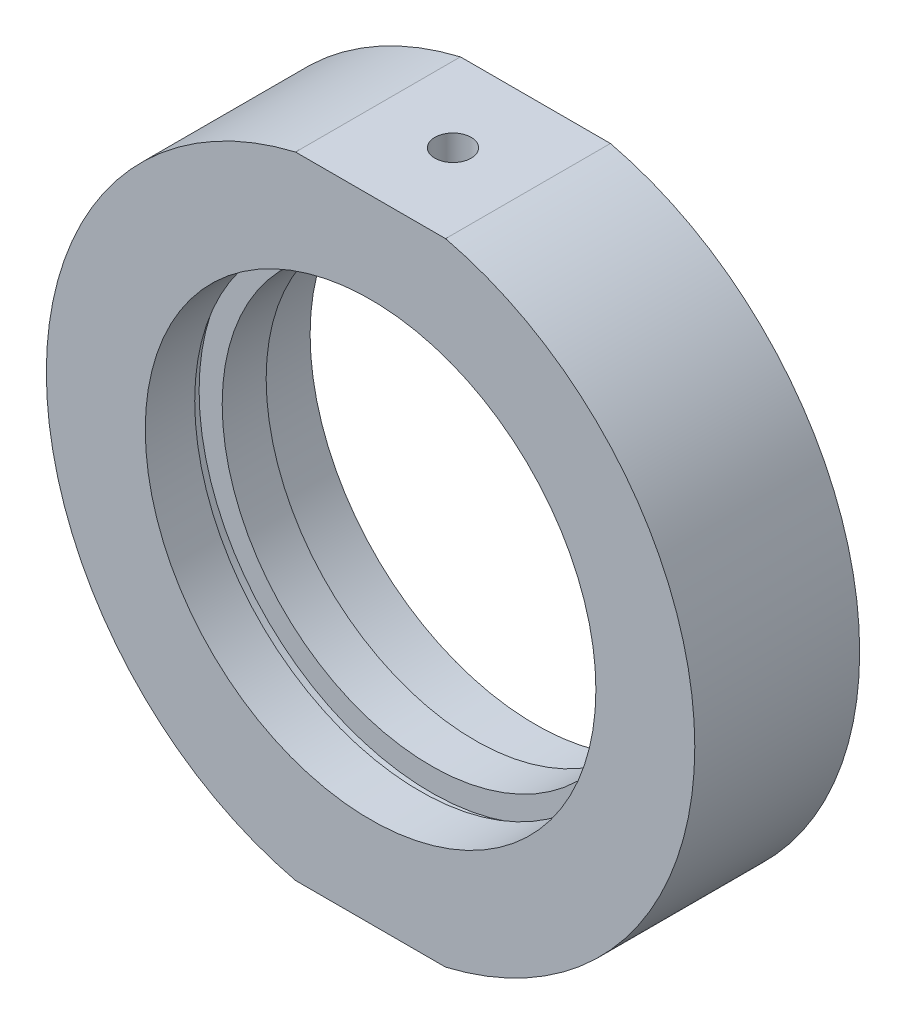
ISO-10303-21;
HEADER;
FILE_DESCRIPTION(('STEP AP214'),'2;1');
FILE_NAME('part.step','',(''),(''),'','','');
FILE_SCHEMA(('AUTOMOTIVE_DESIGN { 1 0 10303 214 1 1 1 1 }'));
ENDSEC;
DATA;
#1=APPLICATION_CONTEXT('core data for automotive mechanical design processes');
#2=APPLICATION_PROTOCOL_DEFINITION('international standard','automotive_design',2000,#1);
#3=PRODUCT_CONTEXT('',#1,'mechanical');
#4=PRODUCT('Part','Part','',(#3));
#5=PRODUCT_RELATED_PRODUCT_CATEGORY('part','',(#4));
#6=PRODUCT_DEFINITION_FORMATION('','',#4);
#7=PRODUCT_DEFINITION_CONTEXT('part definition',#1,'design');
#8=PRODUCT_DEFINITION('design','',#6,#7);
#9=PRODUCT_DEFINITION_SHAPE('','',#8);
#10=(LENGTH_UNIT() NAMED_UNIT(*) SI_UNIT(.MILLI.,.METRE.));
#11=(NAMED_UNIT(*) PLANE_ANGLE_UNIT() SI_UNIT($,.RADIAN.));
#12=(NAMED_UNIT(*) SI_UNIT($,.STERADIAN.) SOLID_ANGLE_UNIT());
#13=UNCERTAINTY_MEASURE_WITH_UNIT(LENGTH_MEASURE(1.E-05),#10,'distance_accuracy_value','');
#14=(GEOMETRIC_REPRESENTATION_CONTEXT(3) GLOBAL_UNCERTAINTY_ASSIGNED_CONTEXT((#13)) GLOBAL_UNIT_ASSIGNED_CONTEXT((#10,
#11,#12)) REPRESENTATION_CONTEXT('',''));
#15=CARTESIAN_POINT('',(0.,0.,0.));
#16=DIRECTION('',(0.,0.,1.));
#17=DIRECTION('',(1.,0.,0.));
#18=AXIS2_PLACEMENT_3D('',#15,#16,#17);
#19=CARTESIAN_POINT('',(0.,0.,-31.9390681003584));
#20=DIRECTION('',(0.,0.,-1.));
#21=DIRECTION('',(-1.,0.,0.));
#22=AXIS2_PLACEMENT_3D('',#19,#20,#21);
#23=CYLINDRICAL_SURFACE('',#22,29.5);
#24=CARTESIAN_POINT('',(0.,0.,7.5));
#25=DIRECTION('',(0.,0.,-1.));
#26=DIRECTION('',(-1.,0.,0.));
#27=AXIS2_PLACEMENT_3D('',#24,#25,#26);
#28=CIRCLE('',#27,29.5);
#29=CARTESIAN_POINT('',(6.82348884369279,28.7,7.5));
#30=VERTEX_POINT('',#29);
#31=CARTESIAN_POINT('',(6.82348884369279,-28.7,7.5));
#32=VERTEX_POINT('',#31);
#33=EDGE_CURVE('E132',#30,#32,#28,.T.);
#34=ORIENTED_EDGE('',*,*,#33,.T.);
#35=DIRECTION('',(0.,0.,-1.));
#36=VECTOR('',#35,1.);
#37=CARTESIAN_POINT('',(6.82348884369281,-28.7,-31.9390681003584));
#38=LINE('',#37,#36);
#39=CARTESIAN_POINT('',(6.82348884369279,-28.7,-7.5));
#40=VERTEX_POINT('',#39);
#41=EDGE_CURVE('E106',#32,#40,#38,.T.);
#42=ORIENTED_EDGE('',*,*,#41,.T.);
#43=CARTESIAN_POINT('',(0.,0.,-7.5));
#44=DIRECTION('',(0.,0.,-1.));
#45=DIRECTION('',(-1.,0.,0.));
#46=AXIS2_PLACEMENT_3D('',#43,#44,#45);
#47=CIRCLE('',#46,29.5);
#48=CARTESIAN_POINT('',(6.82348884369279,28.7,-7.5));
#49=VERTEX_POINT('',#48);
#50=EDGE_CURVE('E128',#49,#40,#47,.T.);
#51=ORIENTED_EDGE('',*,*,#50,.F.);
#52=DIRECTION('',(0.,0.,-1.));
#53=VECTOR('',#52,1.);
#54=CARTESIAN_POINT('',(6.82348884369281,28.7,-31.9390681003584));
#55=LINE('',#54,#53);
#56=EDGE_CURVE('E59',#49,#30,#55,.F.);
#57=ORIENTED_EDGE('',*,*,#56,.T.);
#58=EDGE_LOOP('',(#34,#42,#51,#57));
#59=FACE_BOUND('',#58,.T.);
#60=ADVANCED_FACE('F37',(#59),#23,.T.);
#61=CARTESIAN_POINT('',(19.,0.,-2.));
#62=DIRECTION('',(0.,0.,1.));
#63=DIRECTION('',(1.,0.,0.));
#64=AXIS2_PLACEMENT_3D('',#61,#62,#63);
#65=PLANE('',#64);
#66=CARTESIAN_POINT('',(0.,0.,-2.));
#67=DIRECTION('',(0.,0.,-1.));
#68=DIRECTION('',(-1.,0.,0.));
#69=AXIS2_PLACEMENT_3D('',#66,#67,#68);
#70=CIRCLE('',#69,19.);
#71=CARTESIAN_POINT('',(-19.,0.,-2.));
#72=VERTEX_POINT('',#71);
#73=EDGE_CURVE('E150',#72,#72,#70,.T.);
#74=ORIENTED_EDGE('',*,*,#73,.F.);
#75=EDGE_LOOP('',(#74));
#76=FACE_BOUND('',#75,.T.);
#77=CARTESIAN_POINT('',(0.,0.,-2.));
#78=DIRECTION('',(0.,0.,-1.));
#79=DIRECTION('',(-1.,0.,0.));
#80=AXIS2_PLACEMENT_3D('',#77,#78,#79);
#81=CIRCLE('',#80,21.1);
#82=CARTESIAN_POINT('',(-21.1,0.,-2.));
#83=VERTEX_POINT('',#82);
#84=EDGE_CURVE('E115',#83,#83,#81,.T.);
#85=ORIENTED_EDGE('',*,*,#84,.T.);
#86=EDGE_LOOP('',(#85));
#87=FACE_BOUND('',#86,.T.);
#88=ADVANCED_FACE('F39',(#76,#87),#65,.F.);
#89=CARTESIAN_POINT('',(0.,0.,-31.9390681003584));
#90=DIRECTION('',(0.,0.,-1.));
#91=DIRECTION('',(-1.,0.,0.));
#92=AXIS2_PLACEMENT_3D('',#89,#90,#91);
#93=CYLINDRICAL_SURFACE('',#92,19.);
#94=CARTESIAN_POINT('',(0.,0.,2.));
#95=DIRECTION('',(0.,0.,-1.));
#96=DIRECTION('',(-1.,0.,0.));
#97=AXIS2_PLACEMENT_3D('',#94,#95,#96);
#98=CIRCLE('',#97,19.);
#99=CARTESIAN_POINT('',(-19.,0.,2.));
#100=VERTEX_POINT('',#99);
#101=EDGE_CURVE('E147',#100,#100,#98,.T.);
#102=ORIENTED_EDGE('',*,*,#101,.F.);
#103=EDGE_LOOP('',(#102));
#104=FACE_BOUND('',#103,.T.);
#105=ORIENTED_EDGE('',*,*,#73,.T.);
#106=EDGE_LOOP('',(#105));
#107=FACE_BOUND('',#106,.T.);
#108=ADVANCED_FACE('F189',(#104,#107),#93,.F.);
#109=CARTESIAN_POINT('',(21.1,0.,2.));
#110=DIRECTION('',(0.,0.,-1.));
#111=DIRECTION('',(-1.,0.,0.));
#112=AXIS2_PLACEMENT_3D('',#109,#110,#111);
#113=PLANE('',#112);
#114=CARTESIAN_POINT('',(0.,0.,1.99999999999999));
#115=DIRECTION('',(0.,0.,-1.));
#116=DIRECTION('',(-1.,0.,0.));
#117=AXIS2_PLACEMENT_3D('',#114,#115,#116);
#118=CIRCLE('',#117,21.1);
#119=CARTESIAN_POINT('',(-21.1,0.,2.));
#120=VERTEX_POINT('',#119);
#121=EDGE_CURVE('E144',#120,#120,#118,.T.);
#122=ORIENTED_EDGE('',*,*,#121,.F.);
#123=EDGE_LOOP('',(#122));
#124=FACE_BOUND('',#123,.T.);
#125=ORIENTED_EDGE('',*,*,#101,.T.);
#126=EDGE_LOOP('',(#125));
#127=FACE_BOUND('',#126,.T.);
#128=ADVANCED_FACE('F214',(#124,#127),#113,.F.);
#129=CARTESIAN_POINT('',(0.,0.,-31.9390681003584));
#130=DIRECTION('',(0.,0.,-1.));
#131=DIRECTION('',(-1.,0.,0.));
#132=AXIS2_PLACEMENT_3D('',#129,#130,#131);
#133=CYLINDRICAL_SURFACE('',#132,21.1);
#134=CARTESIAN_POINT('',(0.,0.,3.));
#135=DIRECTION('',(0.,0.,-1.));
#136=DIRECTION('',(-1.,0.,0.));
#137=AXIS2_PLACEMENT_3D('',#134,#135,#136);
#138=CIRCLE('',#137,21.1);
#139=CARTESIAN_POINT('',(-21.1,0.,3.));
#140=VERTEX_POINT('',#139);
#141=EDGE_CURVE('E141',#140,#140,#138,.T.);
#142=ORIENTED_EDGE('',*,*,#141,.F.);
#143=EDGE_LOOP('',(#142));
#144=FACE_BOUND('',#143,.T.);
#145=ORIENTED_EDGE('',*,*,#121,.T.);
#146=EDGE_LOOP('',(#145));
#147=FACE_BOUND('',#146,.T.);
#148=ADVANCED_FACE('F210',(#144,#147),#133,.F.);
#149=CARTESIAN_POINT('',(21.1,0.,3.));
#150=DIRECTION('',(0.,0.,1.));
#151=DIRECTION('',(1.,0.,0.));
#152=AXIS2_PLACEMENT_3D('',#149,#150,#151);
#153=PLANE('',#152);
#154=CARTESIAN_POINT('',(0.,0.,3.));
#155=DIRECTION('',(0.,0.,-1.));
#156=DIRECTION('',(-1.,0.,0.));
#157=AXIS2_PLACEMENT_3D('',#154,#155,#156);
#158=CIRCLE('',#157,20.5);
#159=CARTESIAN_POINT('',(-20.5,0.,3.));
#160=VERTEX_POINT('',#159);
#161=EDGE_CURVE('E138',#160,#160,#158,.T.);
#162=ORIENTED_EDGE('',*,*,#161,.F.);
#163=EDGE_LOOP('',(#162));
#164=FACE_BOUND('',#163,.T.);
#165=ORIENTED_EDGE('',*,*,#141,.T.);
#166=EDGE_LOOP('',(#165));
#167=FACE_BOUND('',#166,.T.);
#168=ADVANCED_FACE('F204',(#164,#167),#153,.F.);
#169=CARTESIAN_POINT('',(0.,0.,-31.9390681003584));
#170=DIRECTION('',(0.,0.,-1.));
#171=DIRECTION('',(-1.,0.,0.));
#172=AXIS2_PLACEMENT_3D('',#169,#170,#171);
#173=CYLINDRICAL_SURFACE('',#172,20.5);
#174=CARTESIAN_POINT('',(0.,0.,7.5));
#175=DIRECTION('',(0.,0.,-1.));
#176=DIRECTION('',(-1.,0.,0.));
#177=AXIS2_PLACEMENT_3D('',#174,#175,#176);
#178=CIRCLE('',#177,20.5);
#179=CARTESIAN_POINT('',(-20.5,0.,7.5));
#180=VERTEX_POINT('',#179);
#181=EDGE_CURVE('E135',#180,#180,#178,.T.);
#182=ORIENTED_EDGE('',*,*,#181,.F.);
#183=EDGE_LOOP('',(#182));
#184=FACE_BOUND('',#183,.T.);
#185=ORIENTED_EDGE('',*,*,#161,.T.);
#186=EDGE_LOOP('',(#185));
#187=FACE_BOUND('',#186,.T.);
#188=ADVANCED_FACE('F200',(#184,#187),#173,.F.);
#189=CARTESIAN_POINT('',(29.5,0.,7.5));
#190=DIRECTION('',(0.,0.,-1.));
#191=DIRECTION('',(-1.,0.,0.));
#192=AXIS2_PLACEMENT_3D('',#189,#190,#191);
#193=PLANE('',#192);
#194=CARTESIAN_POINT('',(-6.82348884369278,-28.7,7.5));
#195=VERTEX_POINT('',#194);
#196=CARTESIAN_POINT('',(-6.82348884369278,28.7,7.5));
#197=VERTEX_POINT('',#196);
#198=EDGE_CURVE('E131',#195,#197,#28,.T.);
#199=ORIENTED_EDGE('',*,*,#198,.F.);
#200=DIRECTION('',(-1.,0.,0.));
#201=VECTOR('',#200,1.);
#202=CARTESIAN_POINT('',(-33.1519726534682,-28.7,7.5));
#203=LINE('',#202,#201);
#204=EDGE_CURVE('E103',#32,#195,#203,.T.);
#205=ORIENTED_EDGE('',*,*,#204,.F.);
#206=ORIENTED_EDGE('',*,*,#33,.F.);
#207=DIRECTION('',(1.,0.,0.));
#208=VECTOR('',#207,1.);
#209=CARTESIAN_POINT('',(-33.1519726534682,28.7,7.5));
#210=LINE('',#209,#208);
#211=EDGE_CURVE('E109',#197,#30,#210,.T.);
#212=ORIENTED_EDGE('',*,*,#211,.F.);
#213=EDGE_LOOP('',(#199,#205,#206,#212));
#214=FACE_BOUND('',#213,.T.);
#215=ORIENTED_EDGE('',*,*,#181,.T.);
#216=EDGE_LOOP('',(#215));
#217=FACE_BOUND('',#216,.T.);
#218=ADVANCED_FACE('F163',(#214,#217),#193,.F.);
#219=CARTESIAN_POINT('',(-6.82348884369279,-28.7,-7.5));
#220=VERTEX_POINT('',#219);
#221=CARTESIAN_POINT('',(-6.82348884369279,28.7,-7.5));
#222=VERTEX_POINT('',#221);
#223=EDGE_CURVE('E127',#220,#222,#47,.T.);
#224=ORIENTED_EDGE('',*,*,#223,.F.);
#225=DIRECTION('',(0.,0.,-1.));
#226=VECTOR('',#225,1.);
#227=CARTESIAN_POINT('',(-6.82348884369281,-28.7,-31.9390681003584));
#228=LINE('',#227,#226);
#229=EDGE_CURVE('E52',#220,#195,#228,.F.);
#230=ORIENTED_EDGE('',*,*,#229,.T.);
#231=ORIENTED_EDGE('',*,*,#198,.T.);
#232=DIRECTION('',(0.,0.,-1.));
#233=VECTOR('',#232,1.);
#234=CARTESIAN_POINT('',(-6.82348884369281,28.7,-31.9390681003584));
#235=LINE('',#234,#233);
#236=EDGE_CURVE('E112',#197,#222,#235,.T.);
#237=ORIENTED_EDGE('',*,*,#236,.T.);
#238=EDGE_LOOP('',(#224,#230,#231,#237));
#239=FACE_BOUND('',#238,.T.);
#240=ADVANCED_FACE('F167',(#239),#23,.T.);
#241=CARTESIAN_POINT('',(20.5,0.,-7.5));
#242=DIRECTION('',(0.,0.,1.));
#243=DIRECTION('',(1.,0.,0.));
#244=AXIS2_PLACEMENT_3D('',#241,#242,#243);
#245=PLANE('',#244);
#246=CARTESIAN_POINT('',(0.,0.,-7.5));
#247=DIRECTION('',(0.,0.,-1.));
#248=DIRECTION('',(-1.,0.,0.));
#249=AXIS2_PLACEMENT_3D('',#246,#247,#248);
#250=CIRCLE('',#249,20.5);
#251=CARTESIAN_POINT('',(-20.5,0.,-7.5));
#252=VERTEX_POINT('',#251);
#253=EDGE_CURVE('E124',#252,#252,#250,.T.);
#254=ORIENTED_EDGE('',*,*,#253,.F.);
#255=EDGE_LOOP('',(#254));
#256=FACE_BOUND('',#255,.T.);
#257=ORIENTED_EDGE('',*,*,#50,.T.);
#258=DIRECTION('',(-1.,0.,0.));
#259=VECTOR('',#258,1.);
#260=CARTESIAN_POINT('',(20.5,-28.7,-7.5));
#261=LINE('',#260,#259);
#262=EDGE_CURVE('E11',#40,#220,#261,.T.);
#263=ORIENTED_EDGE('',*,*,#262,.T.);
#264=ORIENTED_EDGE('',*,*,#223,.T.);
#265=DIRECTION('',(1.,0.,0.));
#266=VECTOR('',#265,1.);
#267=CARTESIAN_POINT('',(20.5,28.7,-7.5));
#268=LINE('',#267,#266);
#269=EDGE_CURVE('E45',#222,#49,#268,.T.);
#270=ORIENTED_EDGE('',*,*,#269,.T.);
#271=EDGE_LOOP('',(#257,#263,#264,#270));
#272=FACE_BOUND('',#271,.T.);
#273=ADVANCED_FACE('F154',(#256,#272),#245,.F.);
#274=CARTESIAN_POINT('',(0.,0.,-31.9390681003584));
#275=DIRECTION('',(0.,0.,-1.));
#276=DIRECTION('',(-1.,0.,0.));
#277=AXIS2_PLACEMENT_3D('',#274,#275,#276);
#278=CYLINDRICAL_SURFACE('',#277,20.5);
#279=CARTESIAN_POINT('',(0.,0.,-3.));
#280=DIRECTION('',(0.,0.,-1.));
#281=DIRECTION('',(-1.,0.,0.));
#282=AXIS2_PLACEMENT_3D('',#279,#280,#281);
#283=CIRCLE('',#282,20.5);
#284=CARTESIAN_POINT('',(-20.5,0.,-3.));
#285=VERTEX_POINT('',#284);
#286=EDGE_CURVE('E121',#285,#285,#283,.T.);
#287=ORIENTED_EDGE('',*,*,#286,.F.);
#288=EDGE_LOOP('',(#287));
#289=FACE_BOUND('',#288,.T.);
#290=ORIENTED_EDGE('',*,*,#253,.T.);
#291=EDGE_LOOP('',(#290));
#292=FACE_BOUND('',#291,.T.);
#293=ADVANCED_FACE('F198',(#289,#292),#278,.F.);
#294=CARTESIAN_POINT('',(21.1,0.,-3.));
#295=DIRECTION('',(0.,0.,-1.));
#296=DIRECTION('',(-1.,0.,0.));
#297=AXIS2_PLACEMENT_3D('',#294,#295,#296);
#298=PLANE('',#297);
#299=CARTESIAN_POINT('',(0.,0.,-3.));
#300=DIRECTION('',(0.,0.,-1.));
#301=DIRECTION('',(-1.,0.,0.));
#302=AXIS2_PLACEMENT_3D('',#299,#300,#301);
#303=CIRCLE('',#302,21.1);
#304=CARTESIAN_POINT('',(-21.1,0.,-3.));
#305=VERTEX_POINT('',#304);
#306=EDGE_CURVE('E118',#305,#305,#303,.T.);
#307=ORIENTED_EDGE('',*,*,#306,.F.);
#308=EDGE_LOOP('',(#307));
#309=FACE_BOUND('',#308,.T.);
#310=ORIENTED_EDGE('',*,*,#286,.T.);
#311=EDGE_LOOP('',(#310));
#312=FACE_BOUND('',#311,.T.);
#313=ADVANCED_FACE('F180',(#309,#312),#298,.F.);
#314=CARTESIAN_POINT('',(0.,0.,-31.9390681003584));
#315=DIRECTION('',(0.,0.,-1.));
#316=DIRECTION('',(-1.,0.,0.));
#317=AXIS2_PLACEMENT_3D('',#314,#315,#316);
#318=CYLINDRICAL_SURFACE('',#317,21.1);
#319=ORIENTED_EDGE('',*,*,#84,.F.);
#320=EDGE_LOOP('',(#319));
#321=FACE_BOUND('',#320,.T.);
#322=ORIENTED_EDGE('',*,*,#306,.T.);
#323=EDGE_LOOP('',(#322));
#324=FACE_BOUND('',#323,.T.);
#325=ADVANCED_FACE('F170',(#321,#324),#318,.F.);
#326=CARTESIAN_POINT('',(-33.1519726534682,28.7,-41.5));
#327=DIRECTION('',(0.,-1.,0.));
#328=DIRECTION('',(0.,0.,-1.));
#329=AXIS2_PLACEMENT_3D('',#326,#327,#328);
#330=PLANE('',#329);
#331=CARTESIAN_POINT('',(0.,28.7,0.));
#332=DIRECTION('',(0.,1.,0.));
#333=DIRECTION('',(0.,0.,1.));
#334=AXIS2_PLACEMENT_3D('',#331,#332,#333);
#335=CIRCLE('',#334,1.64999999999999);
#336=CARTESIAN_POINT('',(0.,28.7,1.64999999999999));
#337=VERTEX_POINT('',#336);
#338=EDGE_CURVE('E92',#337,#337,#335,.T.);
#339=ORIENTED_EDGE('',*,*,#338,.F.);
#340=EDGE_LOOP('',(#339));
#341=FACE_BOUND('',#340,.T.);
#342=ORIENTED_EDGE('',*,*,#211,.T.);
#343=ORIENTED_EDGE('',*,*,#56,.F.);
#344=ORIENTED_EDGE('',*,*,#269,.F.);
#345=ORIENTED_EDGE('',*,*,#236,.F.);
#346=EDGE_LOOP('',(#342,#343,#344,#345));
#347=FACE_BOUND('',#346,.T.);
#348=ADVANCED_FACE('F168',(#341,#347),#330,.F.);
#349=CARTESIAN_POINT('',(-33.1519726534682,-28.7,-41.5));
#350=DIRECTION('',(0.,1.,0.));
#351=DIRECTION('',(0.,0.,1.));
#352=AXIS2_PLACEMENT_3D('',#349,#350,#351);
#353=PLANE('',#352);
#354=CARTESIAN_POINT('',(0.,-28.7,0.));
#355=DIRECTION('',(0.,-1.,0.));
#356=DIRECTION('',(0.,0.,-1.));
#357=AXIS2_PLACEMENT_3D('',#354,#355,#356);
#358=CIRCLE('',#357,2.5);
#359=CARTESIAN_POINT('',(0.,-28.7,-2.5));
#360=VERTEX_POINT('',#359);
#361=EDGE_CURVE('E93',#360,#360,#358,.T.);
#362=ORIENTED_EDGE('',*,*,#361,.F.);
#363=EDGE_LOOP('',(#362));
#364=FACE_BOUND('',#363,.T.);
#365=ORIENTED_EDGE('',*,*,#204,.T.);
#366=ORIENTED_EDGE('',*,*,#229,.F.);
#367=ORIENTED_EDGE('',*,*,#262,.F.);
#368=ORIENTED_EDGE('',*,*,#41,.F.);
#369=EDGE_LOOP('',(#365,#366,#367,#368));
#370=FACE_BOUND('',#369,.T.);
#371=ADVANCED_FACE('F160',(#364,#370),#353,.F.);
#372=CARTESIAN_POINT('',(0.,23.2,0.));
#373=DIRECTION('',(0.,1.,0.));
#374=DIRECTION('',(0.,0.,1.));
#375=AXIS2_PLACEMENT_3D('',#372,#373,#374);
#376=CONICAL_SURFACE('',#375,1.65,1.02974425867665);
#377=CARTESIAN_POINT('',(0.,22.2085799786045,0.));
#378=VERTEX_POINT('',#377);
#379=VERTEX_LOOP('',#378);
#380=FACE_BOUND('',#379,.T.);
#381=CARTESIAN_POINT('',(0.,23.2,0.));
#382=DIRECTION('',(0.,1.,0.));
#383=DIRECTION('',(0.,0.,1.));
#384=AXIS2_PLACEMENT_3D('',#381,#382,#383);
#385=CIRCLE('',#384,1.65);
#386=CARTESIAN_POINT('',(0.,23.2,1.65));
#387=VERTEX_POINT('',#386);
#388=EDGE_CURVE('E96',#387,#387,#385,.T.);
#389=ORIENTED_EDGE('',*,*,#388,.T.);
#390=EDGE_LOOP('',(#389));
#391=FACE_BOUND('',#390,.T.);
#392=ADVANCED_FACE('F177',(#380,#391),#376,.F.);
#393=CARTESIAN_POINT('',(0.,28.7,0.));
#394=DIRECTION('',(0.,1.,0.));
#395=DIRECTION('',(0.,0.,1.));
#396=AXIS2_PLACEMENT_3D('',#393,#394,#395);
#397=CYLINDRICAL_SURFACE('',#396,1.64999999999999);
#398=ORIENTED_EDGE('',*,*,#388,.F.);
#399=EDGE_LOOP('',(#398));
#400=FACE_BOUND('',#399,.T.);
#401=ORIENTED_EDGE('',*,*,#338,.T.);
#402=EDGE_LOOP('',(#401));
#403=FACE_BOUND('',#402,.T.);
#404=ADVANCED_FACE('F86',(#400,#403),#397,.F.);
#405=CARTESIAN_POINT('',(0.,-23.2,0.));
#406=DIRECTION('',(0.,-1.,0.));
#407=DIRECTION('',(0.,0.,-1.));
#408=AXIS2_PLACEMENT_3D('',#405,#406,#407);
#409=CONICAL_SURFACE('',#408,2.5,1.02974425867665);
#410=CARTESIAN_POINT('',(0.,-21.6978484524311,0.));
#411=VERTEX_POINT('',#410);
#412=VERTEX_LOOP('',#411);
#413=FACE_BOUND('',#412,.T.);
#414=CARTESIAN_POINT('',(0.,-23.2,0.));
#415=DIRECTION('',(0.,-1.,0.));
#416=DIRECTION('',(0.,0.,-1.));
#417=AXIS2_PLACEMENT_3D('',#414,#415,#416);
#418=CIRCLE('',#417,2.5);
#419=CARTESIAN_POINT('',(0.,-23.2,-2.5));
#420=VERTEX_POINT('',#419);
#421=EDGE_CURVE('E90',#420,#420,#418,.T.);
#422=ORIENTED_EDGE('',*,*,#421,.T.);
#423=EDGE_LOOP('',(#422));
#424=FACE_BOUND('',#423,.T.);
#425=ADVANCED_FACE('F82',(#413,#424),#409,.F.);
#426=CARTESIAN_POINT('',(0.,-28.7,0.));
#427=DIRECTION('',(0.,-1.,0.));
#428=DIRECTION('',(0.,0.,-1.));
#429=AXIS2_PLACEMENT_3D('',#426,#427,#428);
#430=CYLINDRICAL_SURFACE('',#429,2.5);
#431=ORIENTED_EDGE('',*,*,#421,.F.);
#432=EDGE_LOOP('',(#431));
#433=FACE_BOUND('',#432,.T.);
#434=ORIENTED_EDGE('',*,*,#361,.T.);
#435=EDGE_LOOP('',(#434));
#436=FACE_BOUND('',#435,.T.);
#437=ADVANCED_FACE('F85',(#433,#436),#430,.F.);
#438=CLOSED_SHELL('',(#60,#88,#108,#128,#148,#168,#188,#218,#240,#273,#293,#313,#325,#348,#371,
#392,#404,#425,#437));
#439=MANIFOLD_SOLID_BREP('B2',#438);
#440=ADVANCED_BREP_SHAPE_REPRESENTATION('',(#18,#439),#14);
#441=SHAPE_DEFINITION_REPRESENTATION(#9,#440);
ENDSEC;
END-ISO-10303-21;
